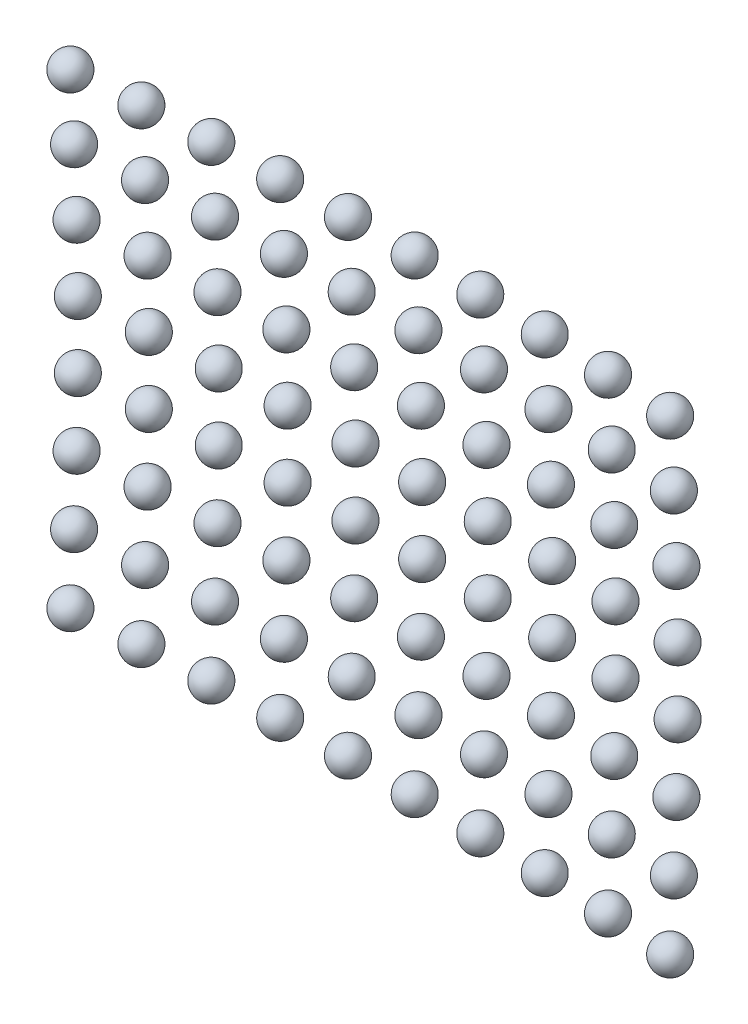
ISO-10303-21;
HEADER;
FILE_DESCRIPTION(('STEP AP214'),'2;1');
FILE_NAME('part.step','',(''),(''),'','','');
FILE_SCHEMA(('AUTOMOTIVE_DESIGN { 1 0 10303 214 1 1 1 1 }'));
ENDSEC;
DATA;
#1=APPLICATION_CONTEXT('core data for automotive mechanical design processes');
#2=APPLICATION_PROTOCOL_DEFINITION('international standard','automotive_design',2000,#1);
#3=PRODUCT_CONTEXT('',#1,'mechanical');
#4=PRODUCT('Part','Part','',(#3));
#5=PRODUCT_RELATED_PRODUCT_CATEGORY('part','',(#4));
#6=PRODUCT_DEFINITION_FORMATION('','',#4);
#7=PRODUCT_DEFINITION_CONTEXT('part definition',#1,'design');
#8=PRODUCT_DEFINITION('design','',#6,#7);
#9=PRODUCT_DEFINITION_SHAPE('','',#8);
#10=(LENGTH_UNIT() NAMED_UNIT(*) SI_UNIT(.MILLI.,.METRE.));
#11=(NAMED_UNIT(*) PLANE_ANGLE_UNIT() SI_UNIT($,.RADIAN.));
#12=(NAMED_UNIT(*) SI_UNIT($,.STERADIAN.) SOLID_ANGLE_UNIT());
#13=UNCERTAINTY_MEASURE_WITH_UNIT(LENGTH_MEASURE(1.E-05),#10,'distance_accuracy_value','');
#14=(GEOMETRIC_REPRESENTATION_CONTEXT(3) GLOBAL_UNCERTAINTY_ASSIGNED_CONTEXT((#13)) GLOBAL_UNIT_ASSIGNED_CONTEXT((#10,
#11,#12)) REPRESENTATION_CONTEXT('',''));
#15=CARTESIAN_POINT('',(0.,0.,0.));
#16=DIRECTION('',(0.,0.,1.));
#17=DIRECTION('',(1.,0.,0.));
#18=AXIS2_PLACEMENT_3D('',#15,#16,#17);
#19=CARTESIAN_POINT('',(8.00817179263601,-6.92631315586949,0.74810256034595));
#20=DIRECTION('',(0.,0.,-1.));
#21=DIRECTION('',(0.,-1.,0.));
#22=AXIS2_PLACEMENT_3D('',#19,#20,#21);
#23=SPHERICAL_SURFACE('',#22,0.5);
#24=CARTESIAN_POINT('',(8.00817179263601,-6.92631315586949,0.24810256034595));
#25=VERTEX_POINT('',#24);
#26=VERTEX_LOOP('',#25);
#27=FACE_BOUND('',#26,.T.);
#28=ADVANCED_FACE('F41',(#27),#23,.T.);
#29=CLOSED_SHELL('',(#28));
#30=MANIFOLD_SOLID_BREP('B2',#29);
#31=CARTESIAN_POINT('',(6.01259338943928,-6.92631315586949,0.615531929738802));
#32=DIRECTION('',(0.,0.,-1.));
#33=DIRECTION('',(0.,-1.,0.));
#34=AXIS2_PLACEMENT_3D('',#31,#32,#33);
#35=SPHERICAL_SURFACE('',#34,0.5);
#36=CARTESIAN_POINT('',(6.01259338943928,-6.92631315586949,0.115531929738802));
#37=VERTEX_POINT('',#36);
#38=VERTEX_LOOP('',#37);
#39=FACE_BOUND('',#38,.T.);
#40=ADVANCED_FACE('F61',(#39),#35,.T.);
#41=CLOSED_SHELL('',(#40));
#42=MANIFOLD_SOLID_BREP('B6',#41);
#43=CARTESIAN_POINT('',(4.01508925056326,-6.92631315586949,0.516106829396567));
#44=DIRECTION('',(0.,0.,-1.));
#45=DIRECTION('',(0.,-1.,0.));
#46=AXIS2_PLACEMENT_3D('',#43,#44,#45);
#47=SPHERICAL_SURFACE('',#46,0.5);
#48=CARTESIAN_POINT('',(4.01508925056326,-6.92631315586949,0.0161068293965674));
#49=VERTEX_POINT('',#48);
#50=VERTEX_LOOP('',#49);
#51=FACE_BOUND('',#50,.T.);
#52=ADVANCED_FACE('F81',(#51),#47,.T.);
#53=CLOSED_SHELL('',(#52));
#54=MANIFOLD_SOLID_BREP('B37',#53);
#55=CARTESIAN_POINT('',(2.01620986814937,-6.92631315586949,0.449854659881427));
#56=DIRECTION('',(0.,0.,-1.));
#57=DIRECTION('',(0.,-1.,0.));
#58=AXIS2_PLACEMENT_3D('',#55,#56,#57);
#59=SPHERICAL_SURFACE('',#58,0.5);
#60=CARTESIAN_POINT('',(2.01620986814937,-6.92631315586949,-0.0501453401185734));
#61=VERTEX_POINT('',#60);
#62=VERTEX_LOOP('',#61);
#63=FACE_BOUND('',#62,.T.);
#64=ADVANCED_FACE('F101',(#63),#59,.T.);
#65=CLOSED_SHELL('',(#64));
#66=MANIFOLD_SOLID_BREP('B57',#65);
#67=CARTESIAN_POINT('',(0.0165061133422777,-6.92631315586949,0.416793679628005));
#68=DIRECTION('',(0.,0.,-1.));
#69=DIRECTION('',(0.,-1.,0.));
#70=AXIS2_PLACEMENT_3D('',#67,#68,#69);
#71=SPHERICAL_SURFACE('',#70,0.5);
#72=CARTESIAN_POINT('',(0.0165061133422777,-6.92631315586949,-0.0832063203719949));
#73=VERTEX_POINT('',#72);
#74=VERTEX_LOOP('',#73);
#75=FACE_BOUND('',#74,.T.);
#76=ADVANCED_FACE('F121',(#75),#71,.T.);
#77=CLOSED_SHELL('',(#76));
#78=MANIFOLD_SOLID_BREP('B77',#77);
#79=CARTESIAN_POINT('',(-1.98347091552447,-6.92631315586949,0.416932999911426));
#80=DIRECTION('',(0.,0.,-1.));
#81=DIRECTION('',(0.,-1.,0.));
#82=AXIS2_PLACEMENT_3D('',#79,#80,#81);
#83=SPHERICAL_SURFACE('',#82,0.5);
#84=CARTESIAN_POINT('',(-1.98347091552447,-6.92631315586949,-0.0830670000885739));
#85=VERTEX_POINT('',#84);
#86=VERTEX_LOOP('',#85);
#87=FACE_BOUND('',#86,.T.);
#88=ADVANCED_FACE('F141',(#87),#83,.T.);
#89=CLOSED_SHELL('',(#88));
#90=MANIFOLD_SOLID_BREP('B97',#89);
#91=CARTESIAN_POINT('',(-3.98317004480583,-6.92631315586949,0.450272582336417));
#92=DIRECTION('',(0.,0.,-1.));
#93=DIRECTION('',(0.,-1.,0.));
#94=AXIS2_PLACEMENT_3D('',#91,#92,#93);
#95=SPHERICAL_SURFACE('',#94,0.5);
#96=CARTESIAN_POINT('',(-3.98317004480583,-6.92631315586949,-0.0497274176635835));
#97=VERTEX_POINT('',#96);
#98=VERTEX_LOOP('',#97);
#99=FACE_BOUND('',#98,.T.);
#100=ADVANCED_FACE('F161',(#99),#95,.T.);
#101=CLOSED_SHELL('',(#100));
#102=MANIFOLD_SOLID_BREP('B117',#101);
#103=CARTESIAN_POINT('',(-5.982040177443,-6.92631315586949,0.516803238847854));
#104=DIRECTION('',(0.,0.,-1.));
#105=DIRECTION('',(0.,-1.,0.));
#106=AXIS2_PLACEMENT_3D('',#103,#104,#105);
#107=SPHERICAL_SURFACE('',#106,0.5);
#108=CARTESIAN_POINT('',(-5.982040177443,-6.92631315586949,0.0168032388478542));
#109=VERTEX_POINT('',#108);
#110=VERTEX_LOOP('',#109);
#111=FACE_BOUND('',#110,.T.);
#112=ADVANCED_FACE('F181',(#111),#107,.T.);
#113=CLOSED_SHELL('',(#112));
#114=MANIFOLD_SOLID_BREP('B137',#113);
#115=CARTESIAN_POINT('',(-7.97953044484047,-6.92631315586949,0.616506634262936));
#116=DIRECTION('',(0.,0.,-1.));
#117=DIRECTION('',(0.,-1.,0.));
#118=AXIS2_PLACEMENT_3D('',#115,#116,#117);
#119=SPHERICAL_SURFACE('',#118,0.5);
#120=CARTESIAN_POINT('',(-7.97953044484047,-6.92631315586949,0.116506634262936));
#121=VERTEX_POINT('',#120);
#122=VERTEX_LOOP('',#121);
#123=FACE_BOUND('',#122,.T.);
#124=ADVANCED_FACE('F201',(#123),#119,.T.);
#125=CLOSED_SHELL('',(#124));
#126=MANIFOLD_SOLID_BREP('B157',#125);
#127=CARTESIAN_POINT('',(-9.97509035867965,-6.92631315586949,0.749355291324124));
#128=DIRECTION('',(0.,0.,-1.));
#129=DIRECTION('',(0.,-1.,0.));
#130=AXIS2_PLACEMENT_3D('',#127,#128,#129);
#131=SPHERICAL_SURFACE('',#130,0.5);
#132=CARTESIAN_POINT('',(-9.97509035867965,-6.92631315586949,0.249355291324124));
#133=VERTEX_POINT('',#132);
#134=VERTEX_LOOP('',#133);
#135=FACE_BOUND('',#134,.T.);
#136=ADVANCED_FACE('F221',(#135),#131,.T.);
#137=CLOSED_SHELL('',(#136));
#138=MANIFOLD_SOLID_BREP('B177',#137);
#139=CARTESIAN_POINT('',(8.00817179263601,-4.92945021760379,0.636643753140584));
#140=DIRECTION('',(0.,0.,-1.));
#141=DIRECTION('',(0.,-1.,0.));
#142=AXIS2_PLACEMENT_3D('',#139,#140,#141);
#143=SPHERICAL_SURFACE('',#142,0.5);
#144=CARTESIAN_POINT('',(8.00817179263601,-4.92945021760379,0.136643753140584));
#145=VERTEX_POINT('',#144);
#146=VERTEX_LOOP('',#145);
#147=FACE_BOUND('',#146,.T.);
#148=ADVANCED_FACE('F241',(#147),#143,.T.);
#149=CLOSED_SHELL('',(#148));
#150=MANIFOLD_SOLID_BREP('B197',#149);
#151=CARTESIAN_POINT('',(6.01259338943928,-4.92945021760379,0.504073122533435));
#152=DIRECTION('',(0.,0.,-1.));
#153=DIRECTION('',(0.,-1.,0.));
#154=AXIS2_PLACEMENT_3D('',#151,#152,#153);
#155=SPHERICAL_SURFACE('',#154,0.5);
#156=CARTESIAN_POINT('',(6.01259338943928,-4.92945021760379,0.00407312253343528));
#157=VERTEX_POINT('',#156);
#158=VERTEX_LOOP('',#157);
#159=FACE_BOUND('',#158,.T.);
#160=ADVANCED_FACE('F261',(#159),#155,.T.);
#161=CLOSED_SHELL('',(#160));
#162=MANIFOLD_SOLID_BREP('B217',#161);
#163=CARTESIAN_POINT('',(4.01508925056326,-4.92945021760379,0.404648022191201));
#164=DIRECTION('',(0.,0.,-1.));
#165=DIRECTION('',(0.,-1.,0.));
#166=AXIS2_PLACEMENT_3D('',#163,#164,#165);
#167=SPHERICAL_SURFACE('',#166,0.5);
#168=CARTESIAN_POINT('',(4.01508925056326,-4.92945021760379,-0.0953519778087994));
#169=VERTEX_POINT('',#168);
#170=VERTEX_LOOP('',#169);
#171=FACE_BOUND('',#170,.T.);
#172=ADVANCED_FACE('F281',(#171),#167,.T.);
#173=CLOSED_SHELL('',(#172));
#174=MANIFOLD_SOLID_BREP('B237',#173);
#175=CARTESIAN_POINT('',(2.01620986814937,-4.92945021760379,0.33839585267606));
#176=DIRECTION('',(0.,0.,-1.));
#177=DIRECTION('',(0.,-1.,0.));
#178=AXIS2_PLACEMENT_3D('',#175,#176,#177);
#179=SPHERICAL_SURFACE('',#178,0.5);
#180=CARTESIAN_POINT('',(2.01620986814937,-4.92945021760379,-0.16160414732394));
#181=VERTEX_POINT('',#180);
#182=VERTEX_LOOP('',#181);
#183=FACE_BOUND('',#182,.T.);
#184=ADVANCED_FACE('F301',(#183),#179,.T.);
#185=CLOSED_SHELL('',(#184));
#186=MANIFOLD_SOLID_BREP('B257',#185);
#187=CARTESIAN_POINT('',(0.0165061133422777,-4.92945021760379,0.305334872422638));
#188=DIRECTION('',(0.,0.,-1.));
#189=DIRECTION('',(0.,-1.,0.));
#190=AXIS2_PLACEMENT_3D('',#187,#188,#189);
#191=SPHERICAL_SURFACE('',#190,0.5);
#192=CARTESIAN_POINT('',(0.0165061133422777,-4.92945021760379,-0.194665127577362));
#193=VERTEX_POINT('',#192);
#194=VERTEX_LOOP('',#193);
#195=FACE_BOUND('',#194,.T.);
#196=ADVANCED_FACE('F321',(#195),#191,.T.);
#197=CLOSED_SHELL('',(#196));
#198=MANIFOLD_SOLID_BREP('B277',#197);
#199=CARTESIAN_POINT('',(-1.98347091552447,-4.92945021760379,0.305474192706059));
#200=DIRECTION('',(0.,0.,-1.));
#201=DIRECTION('',(0.,-1.,0.));
#202=AXIS2_PLACEMENT_3D('',#199,#200,#201);
#203=SPHERICAL_SURFACE('',#202,0.5);
#204=CARTESIAN_POINT('',(-1.98347091552447,-4.92945021760379,-0.194525807293941));
#205=VERTEX_POINT('',#204);
#206=VERTEX_LOOP('',#205);
#207=FACE_BOUND('',#206,.T.);
#208=ADVANCED_FACE('F341',(#207),#203,.T.);
#209=CLOSED_SHELL('',(#208));
#210=MANIFOLD_SOLID_BREP('B297',#209);
#211=CARTESIAN_POINT('',(-3.98317004480583,-4.92945021760379,0.33881377513105));
#212=DIRECTION('',(0.,0.,-1.));
#213=DIRECTION('',(0.,-1.,0.));
#214=AXIS2_PLACEMENT_3D('',#211,#212,#213);
#215=SPHERICAL_SURFACE('',#214,0.5);
#216=CARTESIAN_POINT('',(-3.98317004480583,-4.92945021760379,-0.16118622486895));
#217=VERTEX_POINT('',#216);
#218=VERTEX_LOOP('',#217);
#219=FACE_BOUND('',#218,.T.);
#220=ADVANCED_FACE('F361',(#219),#215,.T.);
#221=CLOSED_SHELL('',(#220));
#222=MANIFOLD_SOLID_BREP('B317',#221);
#223=CARTESIAN_POINT('',(-5.982040177443,-4.92945021760379,0.405344431642487));
#224=DIRECTION('',(0.,0.,-1.));
#225=DIRECTION('',(0.,-1.,0.));
#226=AXIS2_PLACEMENT_3D('',#223,#224,#225);
#227=SPHERICAL_SURFACE('',#226,0.5);
#228=CARTESIAN_POINT('',(-5.982040177443,-4.92945021760379,-0.0946555683575127));
#229=VERTEX_POINT('',#228);
#230=VERTEX_LOOP('',#229);
#231=FACE_BOUND('',#230,.T.);
#232=ADVANCED_FACE('F381',(#231),#227,.T.);
#233=CLOSED_SHELL('',(#232));
#234=MANIFOLD_SOLID_BREP('B337',#233);
#235=CARTESIAN_POINT('',(-7.97953044484047,-4.92945021760379,0.50504782705757));
#236=DIRECTION('',(0.,0.,-1.));
#237=DIRECTION('',(0.,-1.,0.));
#238=AXIS2_PLACEMENT_3D('',#235,#236,#237);
#239=SPHERICAL_SURFACE('',#238,0.5);
#240=CARTESIAN_POINT('',(-7.97953044484047,-4.92945021760379,0.00504782705756956));
#241=VERTEX_POINT('',#240);
#242=VERTEX_LOOP('',#241);
#243=FACE_BOUND('',#242,.T.);
#244=ADVANCED_FACE('F401',(#243),#239,.T.);
#245=CLOSED_SHELL('',(#244));
#246=MANIFOLD_SOLID_BREP('B357',#245);
#247=CARTESIAN_POINT('',(-9.97509035867965,-4.92945021760379,0.637896484118758));
#248=DIRECTION('',(0.,0.,-1.));
#249=DIRECTION('',(0.,-1.,0.));
#250=AXIS2_PLACEMENT_3D('',#247,#248,#249);
#251=SPHERICAL_SURFACE('',#250,0.5);
#252=CARTESIAN_POINT('',(-9.97509035867965,-4.92945021760379,0.137896484118758));
#253=VERTEX_POINT('',#252);
#254=VERTEX_LOOP('',#253);
#255=FACE_BOUND('',#254,.T.);
#256=ADVANCED_FACE('F421',(#255),#251,.T.);
#257=CLOSED_SHELL('',(#256));
#258=MANIFOLD_SOLID_BREP('B377',#257);
#259=CARTESIAN_POINT('',(8.00817179263601,-2.93085954418814,0.56234718485551));
#260=DIRECTION('',(0.,0.,-1.));
#261=DIRECTION('',(0.,-1.,0.));
#262=AXIS2_PLACEMENT_3D('',#259,#260,#261);
#263=SPHERICAL_SURFACE('',#262,0.5);
#264=CARTESIAN_POINT('',(8.00817179263601,-2.93085954418814,0.0623471848555104));
#265=VERTEX_POINT('',#264);
#266=VERTEX_LOOP('',#265);
#267=FACE_BOUND('',#266,.T.);
#268=ADVANCED_FACE('F441',(#267),#263,.T.);
#269=CLOSED_SHELL('',(#268));
#270=MANIFOLD_SOLID_BREP('B397',#269);
#271=CARTESIAN_POINT('',(6.01259338943928,-2.93085954418814,0.429776554248362));
#272=DIRECTION('',(0.,0.,-1.));
#273=DIRECTION('',(0.,-1.,0.));
#274=AXIS2_PLACEMENT_3D('',#271,#272,#273);
#275=SPHERICAL_SURFACE('',#274,0.5);
#276=CARTESIAN_POINT('',(6.01259338943928,-2.93085954418814,-0.070223445751638));
#277=VERTEX_POINT('',#276);
#278=VERTEX_LOOP('',#277);
#279=FACE_BOUND('',#278,.T.);
#280=ADVANCED_FACE('F461',(#279),#275,.T.);
#281=CLOSED_SHELL('',(#280));
#282=MANIFOLD_SOLID_BREP('B417',#281);
#283=CARTESIAN_POINT('',(4.01508925056326,-2.93085954418814,0.330351453906127));
#284=DIRECTION('',(0.,0.,-1.));
#285=DIRECTION('',(0.,-1.,0.));
#286=AXIS2_PLACEMENT_3D('',#283,#284,#285);
#287=SPHERICAL_SURFACE('',#286,0.5);
#288=CARTESIAN_POINT('',(4.01508925056326,-2.93085954418814,-0.169648546093873));
#289=VERTEX_POINT('',#288);
#290=VERTEX_LOOP('',#289);
#291=FACE_BOUND('',#290,.T.);
#292=ADVANCED_FACE('F481',(#291),#287,.T.);
#293=CLOSED_SHELL('',(#292));
#294=MANIFOLD_SOLID_BREP('B437',#293);
#295=CARTESIAN_POINT('',(2.01620986814937,-2.93085954418814,0.264099284390987));
#296=DIRECTION('',(0.,0.,-1.));
#297=DIRECTION('',(0.,-1.,0.));
#298=AXIS2_PLACEMENT_3D('',#295,#296,#297);
#299=SPHERICAL_SURFACE('',#298,0.5);
#300=CARTESIAN_POINT('',(2.01620986814937,-2.93085954418814,-0.235900715609013));
#301=VERTEX_POINT('',#300);
#302=VERTEX_LOOP('',#301);
#303=FACE_BOUND('',#302,.T.);
#304=ADVANCED_FACE('F501',(#303),#299,.T.);
#305=CLOSED_SHELL('',(#304));
#306=MANIFOLD_SOLID_BREP('B457',#305);
#307=CARTESIAN_POINT('',(0.0165061133422777,-2.93085954418814,0.231038304137565));
#308=DIRECTION('',(0.,0.,-1.));
#309=DIRECTION('',(0.,-1.,0.));
#310=AXIS2_PLACEMENT_3D('',#307,#308,#309);
#311=SPHERICAL_SURFACE('',#310,0.5);
#312=CARTESIAN_POINT('',(0.0165061133422777,-2.93085954418814,-0.268961695862435));
#313=VERTEX_POINT('',#312);
#314=VERTEX_LOOP('',#313);
#315=FACE_BOUND('',#314,.T.);
#316=ADVANCED_FACE('F521',(#315),#311,.T.);
#317=CLOSED_SHELL('',(#316));
#318=MANIFOLD_SOLID_BREP('B477',#317);
#319=CARTESIAN_POINT('',(-1.98347091552447,-2.93085954418814,0.231177624420986));
#320=DIRECTION('',(0.,0.,-1.));
#321=DIRECTION('',(0.,-1.,0.));
#322=AXIS2_PLACEMENT_3D('',#319,#320,#321);
#323=SPHERICAL_SURFACE('',#322,0.5);
#324=CARTESIAN_POINT('',(-1.98347091552447,-2.93085954418814,-0.268822375579014));
#325=VERTEX_POINT('',#324);
#326=VERTEX_LOOP('',#325);
#327=FACE_BOUND('',#326,.T.);
#328=ADVANCED_FACE('F541',(#327),#323,.T.);
#329=CLOSED_SHELL('',(#328));
#330=MANIFOLD_SOLID_BREP('B497',#329);
#331=CARTESIAN_POINT('',(-3.98317004480583,-2.93085954418814,0.264517206845976));
#332=DIRECTION('',(0.,0.,-1.));
#333=DIRECTION('',(0.,-1.,0.));
#334=AXIS2_PLACEMENT_3D('',#331,#332,#333);
#335=SPHERICAL_SURFACE('',#334,0.5);
#336=CARTESIAN_POINT('',(-3.98317004480583,-2.93085954418814,-0.235482793154024));
#337=VERTEX_POINT('',#336);
#338=VERTEX_LOOP('',#337);
#339=FACE_BOUND('',#338,.T.);
#340=ADVANCED_FACE('F561',(#339),#335,.T.);
#341=CLOSED_SHELL('',(#340));
#342=MANIFOLD_SOLID_BREP('B517',#341);
#343=CARTESIAN_POINT('',(-5.982040177443,-2.93085954418814,0.331047863357414));
#344=DIRECTION('',(0.,0.,-1.));
#345=DIRECTION('',(0.,-1.,0.));
#346=AXIS2_PLACEMENT_3D('',#343,#344,#345);
#347=SPHERICAL_SURFACE('',#346,0.5);
#348=CARTESIAN_POINT('',(-5.982040177443,-2.93085954418814,-0.168952136642586));
#349=VERTEX_POINT('',#348);
#350=VERTEX_LOOP('',#349);
#351=FACE_BOUND('',#350,.T.);
#352=ADVANCED_FACE('F581',(#351),#347,.T.);
#353=CLOSED_SHELL('',(#352));
#354=MANIFOLD_SOLID_BREP('B537',#353);
#355=CARTESIAN_POINT('',(-7.97953044484047,-2.93085954418814,0.430751258772496));
#356=DIRECTION('',(0.,0.,-1.));
#357=DIRECTION('',(0.,-1.,0.));
#358=AXIS2_PLACEMENT_3D('',#355,#356,#357);
#359=SPHERICAL_SURFACE('',#358,0.5);
#360=CARTESIAN_POINT('',(-7.97953044484047,-2.93085954418814,-0.0692487412275037));
#361=VERTEX_POINT('',#360);
#362=VERTEX_LOOP('',#361);
#363=FACE_BOUND('',#362,.T.);
#364=ADVANCED_FACE('F601',(#363),#359,.T.);
#365=CLOSED_SHELL('',(#364));
#366=MANIFOLD_SOLID_BREP('B557',#365);
#367=CARTESIAN_POINT('',(-9.97509035867965,-2.93085954418814,0.563599915833684));
#368=DIRECTION('',(0.,0.,-1.));
#369=DIRECTION('',(0.,-1.,0.));
#370=AXIS2_PLACEMENT_3D('',#367,#368,#369);
#371=SPHERICAL_SURFACE('',#370,0.5);
#372=CARTESIAN_POINT('',(-9.97509035867965,-2.93085954418814,0.0635999158336844));
#373=VERTEX_POINT('',#372);
#374=VERTEX_LOOP('',#373);
#375=FACE_BOUND('',#374,.T.);
#376=ADVANCED_FACE('F621',(#375),#371,.T.);
#377=CLOSED_SHELL('',(#376));
#378=MANIFOLD_SOLID_BREP('B577',#377);
#379=CARTESIAN_POINT('',(8.00817179263601,-0.931232676465381,0.525238563161723));
#380=DIRECTION('',(0.,0.,-1.));
#381=DIRECTION('',(0.,-1.,0.));
#382=AXIS2_PLACEMENT_3D('',#379,#380,#381);
#383=SPHERICAL_SURFACE('',#382,0.5);
#384=CARTESIAN_POINT('',(8.00817179263601,-0.931232676465381,0.0252385631617227));
#385=VERTEX_POINT('',#384);
#386=VERTEX_LOOP('',#385);
#387=FACE_BOUND('',#386,.T.);
#388=ADVANCED_FACE('F641',(#387),#383,.T.);
#389=CLOSED_SHELL('',(#388));
#390=MANIFOLD_SOLID_BREP('B597',#389);
#391=CARTESIAN_POINT('',(6.01259338943928,-0.931232676465381,0.392667932554574));
#392=DIRECTION('',(0.,0.,-1.));
#393=DIRECTION('',(0.,-1.,0.));
#394=AXIS2_PLACEMENT_3D('',#391,#392,#393);
#395=SPHERICAL_SURFACE('',#394,0.5);
#396=CARTESIAN_POINT('',(6.01259338943928,-0.931232676465381,-0.107332067445426));
#397=VERTEX_POINT('',#396);
#398=VERTEX_LOOP('',#397);
#399=FACE_BOUND('',#398,.T.);
#400=ADVANCED_FACE('F661',(#399),#395,.T.);
#401=CLOSED_SHELL('',(#400));
#402=MANIFOLD_SOLID_BREP('B617',#401);
#403=CARTESIAN_POINT('',(4.01508925056326,-0.931232676465381,0.29324283221234));
#404=DIRECTION('',(0.,0.,-1.));
#405=DIRECTION('',(0.,-1.,0.));
#406=AXIS2_PLACEMENT_3D('',#403,#404,#405);
#407=SPHERICAL_SURFACE('',#406,0.5);
#408=CARTESIAN_POINT('',(4.01508925056326,-0.931232676465381,-0.20675716778766));
#409=VERTEX_POINT('',#408);
#410=VERTEX_LOOP('',#409);
#411=FACE_BOUND('',#410,.T.);
#412=ADVANCED_FACE('F681',(#411),#407,.T.);
#413=CLOSED_SHELL('',(#412));
#414=MANIFOLD_SOLID_BREP('B637',#413);
#415=CARTESIAN_POINT('',(2.01620986814937,-0.931232676465381,0.226990662697199));
#416=DIRECTION('',(0.,0.,-1.));
#417=DIRECTION('',(0.,-1.,0.));
#418=AXIS2_PLACEMENT_3D('',#415,#416,#417);
#419=SPHERICAL_SURFACE('',#418,0.5);
#420=CARTESIAN_POINT('',(2.01620986814937,-0.931232676465381,-0.273009337302801));
#421=VERTEX_POINT('',#420);
#422=VERTEX_LOOP('',#421);
#423=FACE_BOUND('',#422,.T.);
#424=ADVANCED_FACE('F701',(#423),#419,.T.);
#425=CLOSED_SHELL('',(#424));
#426=MANIFOLD_SOLID_BREP('B657',#425);
#427=CARTESIAN_POINT('',(0.0165061133422777,-0.931232676465381,0.193929682443777));
#428=DIRECTION('',(0.,0.,-1.));
#429=DIRECTION('',(0.,-1.,0.));
#430=AXIS2_PLACEMENT_3D('',#427,#428,#429);
#431=SPHERICAL_SURFACE('',#430,0.5);
#432=CARTESIAN_POINT('',(0.0165061133422777,-0.931232676465381,-0.306070317556223));
#433=VERTEX_POINT('',#432);
#434=VERTEX_LOOP('',#433);
#435=FACE_BOUND('',#434,.T.);
#436=ADVANCED_FACE('F721',(#435),#431,.T.);
#437=CLOSED_SHELL('',(#436));
#438=MANIFOLD_SOLID_BREP('B677',#437);
#439=CARTESIAN_POINT('',(-1.98347091552447,-0.931232676465381,0.194069002727198));
#440=DIRECTION('',(0.,0.,-1.));
#441=DIRECTION('',(0.,-1.,0.));
#442=AXIS2_PLACEMENT_3D('',#439,#440,#441);
#443=SPHERICAL_SURFACE('',#442,0.5);
#444=CARTESIAN_POINT('',(-1.98347091552447,-0.931232676465381,-0.305930997272802));
#445=VERTEX_POINT('',#444);
#446=VERTEX_LOOP('',#445);
#447=FACE_BOUND('',#446,.T.);
#448=ADVANCED_FACE('F741',(#447),#443,.T.);
#449=CLOSED_SHELL('',(#448));
#450=MANIFOLD_SOLID_BREP('B697',#449);
#451=CARTESIAN_POINT('',(-3.98317004480583,-0.931232676465381,0.227408585152189));
#452=DIRECTION('',(0.,0.,-1.));
#453=DIRECTION('',(0.,-1.,0.));
#454=AXIS2_PLACEMENT_3D('',#451,#452,#453);
#455=SPHERICAL_SURFACE('',#454,0.5);
#456=CARTESIAN_POINT('',(-3.98317004480583,-0.931232676465381,-0.272591414847811));
#457=VERTEX_POINT('',#456);
#458=VERTEX_LOOP('',#457);
#459=FACE_BOUND('',#458,.T.);
#460=ADVANCED_FACE('F761',(#459),#455,.T.);
#461=CLOSED_SHELL('',(#460));
#462=MANIFOLD_SOLID_BREP('B717',#461);
#463=CARTESIAN_POINT('',(-5.982040177443,-0.931232676465381,0.293939241663626));
#464=DIRECTION('',(0.,0.,-1.));
#465=DIRECTION('',(0.,-1.,0.));
#466=AXIS2_PLACEMENT_3D('',#463,#464,#465);
#467=SPHERICAL_SURFACE('',#466,0.5);
#468=CARTESIAN_POINT('',(-5.982040177443,-0.931232676465381,-0.206060758336374));
#469=VERTEX_POINT('',#468);
#470=VERTEX_LOOP('',#469);
#471=FACE_BOUND('',#470,.T.);
#472=ADVANCED_FACE('F781',(#471),#467,.T.);
#473=CLOSED_SHELL('',(#472));
#474=MANIFOLD_SOLID_BREP('B737',#473);
#475=CARTESIAN_POINT('',(-7.97953044484047,-0.931232676465381,0.393642637078709));
#476=DIRECTION('',(0.,0.,-1.));
#477=DIRECTION('',(0.,-1.,0.));
#478=AXIS2_PLACEMENT_3D('',#475,#476,#477);
#479=SPHERICAL_SURFACE('',#478,0.5);
#480=CARTESIAN_POINT('',(-7.97953044484047,-0.931232676465381,-0.106357362921291));
#481=VERTEX_POINT('',#480);
#482=VERTEX_LOOP('',#481);
#483=FACE_BOUND('',#482,.T.);
#484=ADVANCED_FACE('F801',(#483),#479,.T.);
#485=CLOSED_SHELL('',(#484));
#486=MANIFOLD_SOLID_BREP('B757',#485);
#487=CARTESIAN_POINT('',(-9.97509035867965,-0.931232676465381,0.526491294139897));
#488=DIRECTION('',(0.,0.,-1.));
#489=DIRECTION('',(0.,-1.,0.));
#490=AXIS2_PLACEMENT_3D('',#487,#488,#489);
#491=SPHERICAL_SURFACE('',#490,0.5);
#492=CARTESIAN_POINT('',(-9.97509035867965,-0.931232676465381,0.0264912941398967));
#493=VERTEX_POINT('',#492);
#494=VERTEX_LOOP('',#493);
#495=FACE_BOUND('',#494,.T.);
#496=ADVANCED_FACE('F821',(#495),#491,.T.);
#497=CLOSED_SHELL('',(#496));
#498=MANIFOLD_SOLID_BREP('B777',#497);
#499=CARTESIAN_POINT('',(8.00817179263601,1.06873848618381,0.525330728170903));
#500=DIRECTION('',(0.,0.,-1.));
#501=DIRECTION('',(0.,-1.,0.));
#502=AXIS2_PLACEMENT_3D('',#499,#500,#501);
#503=SPHERICAL_SURFACE('',#502,0.5);
#504=CARTESIAN_POINT('',(8.00817179263601,1.06873848618381,0.0253307281709028));
#505=VERTEX_POINT('',#504);
#506=VERTEX_LOOP('',#505);
#507=FACE_BOUND('',#506,.T.);
#508=ADVANCED_FACE('F841',(#507),#503,.T.);
#509=CLOSED_SHELL('',(#508));
#510=MANIFOLD_SOLID_BREP('B797',#509);
#511=CARTESIAN_POINT('',(6.01259338943928,1.06873848618381,0.392760097563754));
#512=DIRECTION('',(0.,0.,-1.));
#513=DIRECTION('',(0.,-1.,0.));
#514=AXIS2_PLACEMENT_3D('',#511,#512,#513);
#515=SPHERICAL_SURFACE('',#514,0.5);
#516=CARTESIAN_POINT('',(6.01259338943928,1.06873848618381,-0.107239902436246));
#517=VERTEX_POINT('',#516);
#518=VERTEX_LOOP('',#517);
#519=FACE_BOUND('',#518,.T.);
#520=ADVANCED_FACE('F861',(#519),#515,.T.);
#521=CLOSED_SHELL('',(#520));
#522=MANIFOLD_SOLID_BREP('B817',#521);
#523=CARTESIAN_POINT('',(4.01508925056326,1.06873848618381,0.29333499722152));
#524=DIRECTION('',(0.,0.,-1.));
#525=DIRECTION('',(0.,-1.,0.));
#526=AXIS2_PLACEMENT_3D('',#523,#524,#525);
#527=SPHERICAL_SURFACE('',#526,0.5);
#528=CARTESIAN_POINT('',(4.01508925056326,1.06873848618381,-0.20666500277848));
#529=VERTEX_POINT('',#528);
#530=VERTEX_LOOP('',#529);
#531=FACE_BOUND('',#530,.T.);
#532=ADVANCED_FACE('F881',(#531),#527,.T.);
#533=CLOSED_SHELL('',(#532));
#534=MANIFOLD_SOLID_BREP('B837',#533);
#535=CARTESIAN_POINT('',(2.01620986814937,1.06873848618381,0.227082827706379));
#536=DIRECTION('',(0.,0.,-1.));
#537=DIRECTION('',(0.,-1.,0.));
#538=AXIS2_PLACEMENT_3D('',#535,#536,#537);
#539=SPHERICAL_SURFACE('',#538,0.5);
#540=CARTESIAN_POINT('',(2.01620986814937,1.06873848618381,-0.272917172293621));
#541=VERTEX_POINT('',#540);
#542=VERTEX_LOOP('',#541);
#543=FACE_BOUND('',#542,.T.);
#544=ADVANCED_FACE('F901',(#543),#539,.T.);
#545=CLOSED_SHELL('',(#544));
#546=MANIFOLD_SOLID_BREP('B857',#545);
#547=CARTESIAN_POINT('',(0.0165061133422777,1.06873848618381,0.194021847452957));
#548=DIRECTION('',(0.,0.,-1.));
#549=DIRECTION('',(0.,-1.,0.));
#550=AXIS2_PLACEMENT_3D('',#547,#548,#549);
#551=SPHERICAL_SURFACE('',#550,0.5);
#552=CARTESIAN_POINT('',(0.0165061133422777,1.06873848618381,-0.305978152547043));
#553=VERTEX_POINT('',#552);
#554=VERTEX_LOOP('',#553);
#555=FACE_BOUND('',#554,.T.);
#556=ADVANCED_FACE('F921',(#555),#551,.T.);
#557=CLOSED_SHELL('',(#556));
#558=MANIFOLD_SOLID_BREP('B877',#557);
#559=CARTESIAN_POINT('',(-1.98347091552447,1.06873848618381,0.194161167736378));
#560=DIRECTION('',(0.,0.,-1.));
#561=DIRECTION('',(0.,-1.,0.));
#562=AXIS2_PLACEMENT_3D('',#559,#560,#561);
#563=SPHERICAL_SURFACE('',#562,0.5);
#564=CARTESIAN_POINT('',(-1.98347091552447,1.06873848618381,-0.305838832263622));
#565=VERTEX_POINT('',#564);
#566=VERTEX_LOOP('',#565);
#567=FACE_BOUND('',#566,.T.);
#568=ADVANCED_FACE('F941',(#567),#563,.T.);
#569=CLOSED_SHELL('',(#568));
#570=MANIFOLD_SOLID_BREP('B897',#569);
#571=CARTESIAN_POINT('',(-3.98317004480583,1.06873848618381,0.227500750161369));
#572=DIRECTION('',(0.,0.,-1.));
#573=DIRECTION('',(0.,-1.,0.));
#574=AXIS2_PLACEMENT_3D('',#571,#572,#573);
#575=SPHERICAL_SURFACE('',#574,0.5);
#576=CARTESIAN_POINT('',(-3.98317004480583,1.06873848618381,-0.272499249838631));
#577=VERTEX_POINT('',#576);
#578=VERTEX_LOOP('',#577);
#579=FACE_BOUND('',#578,.T.);
#580=ADVANCED_FACE('F961',(#579),#575,.T.);
#581=CLOSED_SHELL('',(#580));
#582=MANIFOLD_SOLID_BREP('B917',#581);
#583=CARTESIAN_POINT('',(-5.982040177443,1.06873848618381,0.294031406672806));
#584=DIRECTION('',(0.,0.,-1.));
#585=DIRECTION('',(0.,-1.,0.));
#586=AXIS2_PLACEMENT_3D('',#583,#584,#585);
#587=SPHERICAL_SURFACE('',#586,0.5);
#588=CARTESIAN_POINT('',(-5.982040177443,1.06873848618381,-0.205968593327194));
#589=VERTEX_POINT('',#588);
#590=VERTEX_LOOP('',#589);
#591=FACE_BOUND('',#590,.T.);
#592=ADVANCED_FACE('F981',(#591),#587,.T.);
#593=CLOSED_SHELL('',(#592));
#594=MANIFOLD_SOLID_BREP('B937',#593);
#595=CARTESIAN_POINT('',(-7.97953044484047,1.06873848618381,0.393734802087889));
#596=DIRECTION('',(0.,0.,-1.));
#597=DIRECTION('',(0.,-1.,0.));
#598=AXIS2_PLACEMENT_3D('',#595,#596,#597);
#599=SPHERICAL_SURFACE('',#598,0.5);
#600=CARTESIAN_POINT('',(-7.97953044484047,1.06873848618381,-0.106265197912111));
#601=VERTEX_POINT('',#600);
#602=VERTEX_LOOP('',#601);
#603=FACE_BOUND('',#602,.T.);
#604=ADVANCED_FACE('F1001',(#603),#599,.T.);
#605=CLOSED_SHELL('',(#604));
#606=MANIFOLD_SOLID_BREP('B957',#605);
#607=CARTESIAN_POINT('',(-9.97509035867965,1.06873848618381,0.526583459149077));
#608=DIRECTION('',(0.,0.,-1.));
#609=DIRECTION('',(0.,-1.,0.));
#610=AXIS2_PLACEMENT_3D('',#607,#608,#609);
#611=SPHERICAL_SURFACE('',#610,0.5);
#612=CARTESIAN_POINT('',(-9.97509035867965,1.06873848618381,0.0265834591490768));
#613=VERTEX_POINT('',#612);
#614=VERTEX_LOOP('',#613);
#615=FACE_BOUND('',#614,.T.);
#616=ADVANCED_FACE('F1021',(#615),#611,.T.);
#617=CLOSED_SHELL('',(#616));
#618=MANIFOLD_SOLID_BREP('B977',#617);
#619=CARTESIAN_POINT('',(8.00817179263601,3.06836192524776,0.562623647992671));
#620=DIRECTION('',(0.,0.,-1.));
#621=DIRECTION('',(0.,-1.,0.));
#622=AXIS2_PLACEMENT_3D('',#619,#620,#621);
#623=SPHERICAL_SURFACE('',#622,0.5);
#624=CARTESIAN_POINT('',(8.00817179263601,3.06836192524776,0.0626236479926714));
#625=VERTEX_POINT('',#624);
#626=VERTEX_LOOP('',#625);
#627=FACE_BOUND('',#626,.T.);
#628=ADVANCED_FACE('F1041',(#627),#623,.T.);
#629=CLOSED_SHELL('',(#628));
#630=MANIFOLD_SOLID_BREP('B997',#629);
#631=CARTESIAN_POINT('',(6.01259338943928,3.06836192524776,0.430053017385523));
#632=DIRECTION('',(0.,0.,-1.));
#633=DIRECTION('',(0.,-1.,0.));
#634=AXIS2_PLACEMENT_3D('',#631,#632,#633);
#635=SPHERICAL_SURFACE('',#634,0.5);
#636=CARTESIAN_POINT('',(6.01259338943928,3.06836192524776,-0.069946982614477));
#637=VERTEX_POINT('',#636);
#638=VERTEX_LOOP('',#637);
#639=FACE_BOUND('',#638,.T.);
#640=ADVANCED_FACE('F1061',(#639),#635,.T.);
#641=CLOSED_SHELL('',(#640));
#642=MANIFOLD_SOLID_BREP('B1017',#641);
#643=CARTESIAN_POINT('',(4.01508925056326,3.06836192524776,0.330627917043288));
#644=DIRECTION('',(0.,0.,-1.));
#645=DIRECTION('',(0.,-1.,0.));
#646=AXIS2_PLACEMENT_3D('',#643,#644,#645);
#647=SPHERICAL_SURFACE('',#646,0.5);
#648=CARTESIAN_POINT('',(4.01508925056326,3.06836192524776,-0.169372082956712));
#649=VERTEX_POINT('',#648);
#650=VERTEX_LOOP('',#649);
#651=FACE_BOUND('',#650,.T.);
#652=ADVANCED_FACE('F1081',(#651),#647,.T.);
#653=CLOSED_SHELL('',(#652));
#654=MANIFOLD_SOLID_BREP('B1037',#653);
#655=CARTESIAN_POINT('',(2.01620986814937,3.06836192524776,0.264375747528148));
#656=DIRECTION('',(0.,0.,-1.));
#657=DIRECTION('',(0.,-1.,0.));
#658=AXIS2_PLACEMENT_3D('',#655,#656,#657);
#659=SPHERICAL_SURFACE('',#658,0.5);
#660=CARTESIAN_POINT('',(2.01620986814937,3.06836192524776,-0.235624252471852));
#661=VERTEX_POINT('',#660);
#662=VERTEX_LOOP('',#661);
#663=FACE_BOUND('',#662,.T.);
#664=ADVANCED_FACE('F1101',(#663),#659,.T.);
#665=CLOSED_SHELL('',(#664));
#666=MANIFOLD_SOLID_BREP('B1057',#665);
#667=CARTESIAN_POINT('',(0.0165061133422777,3.06836192524776,0.231314767274726));
#668=DIRECTION('',(0.,0.,-1.));
#669=DIRECTION('',(0.,-1.,0.));
#670=AXIS2_PLACEMENT_3D('',#667,#668,#669);
#671=SPHERICAL_SURFACE('',#670,0.5);
#672=CARTESIAN_POINT('',(0.0165061133422777,3.06836192524776,-0.268685232725274));
#673=VERTEX_POINT('',#672);
#674=VERTEX_LOOP('',#673);
#675=FACE_BOUND('',#674,.T.);
#676=ADVANCED_FACE('F1121',(#675),#671,.T.);
#677=CLOSED_SHELL('',(#676));
#678=MANIFOLD_SOLID_BREP('B1077',#677);
#679=CARTESIAN_POINT('',(-1.98347091552447,3.06836192524776,0.231454087558147));
#680=DIRECTION('',(0.,0.,-1.));
#681=DIRECTION('',(0.,-1.,0.));
#682=AXIS2_PLACEMENT_3D('',#679,#680,#681);
#683=SPHERICAL_SURFACE('',#682,0.5);
#684=CARTESIAN_POINT('',(-1.98347091552447,3.06836192524776,-0.268545912441853));
#685=VERTEX_POINT('',#684);
#686=VERTEX_LOOP('',#685);
#687=FACE_BOUND('',#686,.T.);
#688=ADVANCED_FACE('F1141',(#687),#683,.T.);
#689=CLOSED_SHELL('',(#688));
#690=MANIFOLD_SOLID_BREP('B1097',#689);
#691=CARTESIAN_POINT('',(-3.98317004480583,3.06836192524776,0.264793669983137));
#692=DIRECTION('',(0.,0.,-1.));
#693=DIRECTION('',(0.,-1.,0.));
#694=AXIS2_PLACEMENT_3D('',#691,#692,#693);
#695=SPHERICAL_SURFACE('',#694,0.5);
#696=CARTESIAN_POINT('',(-3.98317004480583,3.06836192524776,-0.235206330016863));
#697=VERTEX_POINT('',#696);
#698=VERTEX_LOOP('',#697);
#699=FACE_BOUND('',#698,.T.);
#700=ADVANCED_FACE('F1161',(#699),#695,.T.);
#701=CLOSED_SHELL('',(#700));
#702=MANIFOLD_SOLID_BREP('B1117',#701);
#703=CARTESIAN_POINT('',(-5.982040177443,3.06836192524776,0.331324326494575));
#704=DIRECTION('',(0.,0.,-1.));
#705=DIRECTION('',(0.,-1.,0.));
#706=AXIS2_PLACEMENT_3D('',#703,#704,#705);
#707=SPHERICAL_SURFACE('',#706,0.5);
#708=CARTESIAN_POINT('',(-5.982040177443,3.06836192524776,-0.168675673505425));
#709=VERTEX_POINT('',#708);
#710=VERTEX_LOOP('',#709);
#711=FACE_BOUND('',#710,.T.);
#712=ADVANCED_FACE('F1181',(#711),#707,.T.);
#713=CLOSED_SHELL('',(#712));
#714=MANIFOLD_SOLID_BREP('B1137',#713);
#715=CARTESIAN_POINT('',(-7.97953044484047,3.06836192524776,0.431027721909657));
#716=DIRECTION('',(0.,0.,-1.));
#717=DIRECTION('',(0.,-1.,0.));
#718=AXIS2_PLACEMENT_3D('',#715,#716,#717);
#719=SPHERICAL_SURFACE('',#718,0.5);
#720=CARTESIAN_POINT('',(-7.97953044484047,3.06836192524776,-0.0689722780903427));
#721=VERTEX_POINT('',#720);
#722=VERTEX_LOOP('',#721);
#723=FACE_BOUND('',#722,.T.);
#724=ADVANCED_FACE('F1201',(#723),#719,.T.);
#725=CLOSED_SHELL('',(#724));
#726=MANIFOLD_SOLID_BREP('B1157',#725);
#727=CARTESIAN_POINT('',(-9.97509035867965,3.06836192524776,0.563876378970845));
#728=DIRECTION('',(0.,0.,-1.));
#729=DIRECTION('',(0.,-1.,0.));
#730=AXIS2_PLACEMENT_3D('',#727,#728,#729);
#731=SPHERICAL_SURFACE('',#730,0.5);
#732=CARTESIAN_POINT('',(-9.97509035867965,3.06836192524776,0.0638763789708454));
#733=VERTEX_POINT('',#732);
#734=VERTEX_LOOP('',#733);
#735=FACE_BOUND('',#734,.T.);
#736=ADVANCED_FACE('F1221',(#735),#731,.T.);
#737=CLOSED_SHELL('',(#736));
#738=MANIFOLD_SOLID_BREP('B1177',#737);
#739=CARTESIAN_POINT('',(8.00817179263601,5.06694574253209,0.637104418745537));
#740=DIRECTION('',(0.,0.,-1.));
#741=DIRECTION('',(0.,-1.,0.));
#742=AXIS2_PLACEMENT_3D('',#739,#740,#741);
#743=SPHERICAL_SURFACE('',#742,0.5);
#744=CARTESIAN_POINT('',(8.00817179263601,5.06694574253209,0.137104418745537));
#745=VERTEX_POINT('',#744);
#746=VERTEX_LOOP('',#745);
#747=FACE_BOUND('',#746,.T.);
#748=ADVANCED_FACE('F1241',(#747),#743,.T.);
#749=CLOSED_SHELL('',(#748));
#750=MANIFOLD_SOLID_BREP('B1197',#749);
#751=CARTESIAN_POINT('',(6.01259338943928,5.06694574253209,0.504533788138389));
#752=DIRECTION('',(0.,0.,-1.));
#753=DIRECTION('',(0.,-1.,0.));
#754=AXIS2_PLACEMENT_3D('',#751,#752,#753);
#755=SPHERICAL_SURFACE('',#754,0.5);
#756=CARTESIAN_POINT('',(6.01259338943928,5.06694574253209,0.00453378813838911));
#757=VERTEX_POINT('',#756);
#758=VERTEX_LOOP('',#757);
#759=FACE_BOUND('',#758,.T.);
#760=ADVANCED_FACE('F1261',(#759),#755,.T.);
#761=CLOSED_SHELL('',(#760));
#762=MANIFOLD_SOLID_BREP('B1217',#761);
#763=CARTESIAN_POINT('',(4.01508925056326,5.06694574253209,0.405108687796154));
#764=DIRECTION('',(0.,0.,-1.));
#765=DIRECTION('',(0.,-1.,0.));
#766=AXIS2_PLACEMENT_3D('',#763,#764,#765);
#767=SPHERICAL_SURFACE('',#766,0.5);
#768=CARTESIAN_POINT('',(4.01508925056326,5.06694574253209,-0.0948913122038456));
#769=VERTEX_POINT('',#768);
#770=VERTEX_LOOP('',#769);
#771=FACE_BOUND('',#770,.T.);
#772=ADVANCED_FACE('F1281',(#771),#767,.T.);
#773=CLOSED_SHELL('',(#772));
#774=MANIFOLD_SOLID_BREP('B1237',#773);
#775=CARTESIAN_POINT('',(2.01620986814937,5.06694574253209,0.338856518281014));
#776=DIRECTION('',(0.,0.,-1.));
#777=DIRECTION('',(0.,-1.,0.));
#778=AXIS2_PLACEMENT_3D('',#775,#776,#777);
#779=SPHERICAL_SURFACE('',#778,0.5);
#780=CARTESIAN_POINT('',(2.01620986814937,5.06694574253209,-0.161143481718986));
#781=VERTEX_POINT('',#780);
#782=VERTEX_LOOP('',#781);
#783=FACE_BOUND('',#782,.T.);
#784=ADVANCED_FACE('F1301',(#783),#779,.T.);
#785=CLOSED_SHELL('',(#784));
#786=MANIFOLD_SOLID_BREP('B1257',#785);
#787=CARTESIAN_POINT('',(0.0165061133422777,5.06694574253209,0.305795538027592));
#788=DIRECTION('',(0.,0.,-1.));
#789=DIRECTION('',(0.,-1.,0.));
#790=AXIS2_PLACEMENT_3D('',#787,#788,#789);
#791=SPHERICAL_SURFACE('',#790,0.5);
#792=CARTESIAN_POINT('',(0.0165061133422777,5.06694574253209,-0.194204461972408));
#793=VERTEX_POINT('',#792);
#794=VERTEX_LOOP('',#793);
#795=FACE_BOUND('',#794,.T.);
#796=ADVANCED_FACE('F1321',(#795),#791,.T.);
#797=CLOSED_SHELL('',(#796));
#798=MANIFOLD_SOLID_BREP('B1277',#797);
#799=CARTESIAN_POINT('',(-1.98347091552447,5.06694574253209,0.305934858311013));
#800=DIRECTION('',(0.,0.,-1.));
#801=DIRECTION('',(0.,-1.,0.));
#802=AXIS2_PLACEMENT_3D('',#799,#800,#801);
#803=SPHERICAL_SURFACE('',#802,0.5);
#804=CARTESIAN_POINT('',(-1.98347091552447,5.06694574253209,-0.194065141688987));
#805=VERTEX_POINT('',#804);
#806=VERTEX_LOOP('',#805);
#807=FACE_BOUND('',#806,.T.);
#808=ADVANCED_FACE('F1341',(#807),#803,.T.);
#809=CLOSED_SHELL('',(#808));
#810=MANIFOLD_SOLID_BREP('B1297',#809);
#811=CARTESIAN_POINT('',(-3.98317004480583,5.06694574253209,0.339274440736004));
#812=DIRECTION('',(0.,0.,-1.));
#813=DIRECTION('',(0.,-1.,0.));
#814=AXIS2_PLACEMENT_3D('',#811,#812,#813);
#815=SPHERICAL_SURFACE('',#814,0.5);
#816=CARTESIAN_POINT('',(-3.98317004480583,5.06694574253209,-0.160725559263996));
#817=VERTEX_POINT('',#816);
#818=VERTEX_LOOP('',#817);
#819=FACE_BOUND('',#818,.T.);
#820=ADVANCED_FACE('F1361',(#819),#815,.T.);
#821=CLOSED_SHELL('',(#820));
#822=MANIFOLD_SOLID_BREP('B1317',#821);
#823=CARTESIAN_POINT('',(-5.982040177443,5.06694574253209,0.405805097247441));
#824=DIRECTION('',(0.,0.,-1.));
#825=DIRECTION('',(0.,-1.,0.));
#826=AXIS2_PLACEMENT_3D('',#823,#824,#825);
#827=SPHERICAL_SURFACE('',#826,0.5);
#828=CARTESIAN_POINT('',(-5.982040177443,5.06694574253209,-0.0941949027525588));
#829=VERTEX_POINT('',#828);
#830=VERTEX_LOOP('',#829);
#831=FACE_BOUND('',#830,.T.);
#832=ADVANCED_FACE('F1381',(#831),#827,.T.);
#833=CLOSED_SHELL('',(#832));
#834=MANIFOLD_SOLID_BREP('B1337',#833);
#835=CARTESIAN_POINT('',(-7.97953044484047,5.06694574253209,0.505508492662523));
#836=DIRECTION('',(0.,0.,-1.));
#837=DIRECTION('',(0.,-1.,0.));
#838=AXIS2_PLACEMENT_3D('',#835,#836,#837);
#839=SPHERICAL_SURFACE('',#838,0.5);
#840=CARTESIAN_POINT('',(-7.97953044484047,5.06694574253209,0.0055084926625234));
#841=VERTEX_POINT('',#840);
#842=VERTEX_LOOP('',#841);
#843=FACE_BOUND('',#842,.T.);
#844=ADVANCED_FACE('F1401',(#843),#839,.T.);
#845=CLOSED_SHELL('',(#844));
#846=MANIFOLD_SOLID_BREP('B1357',#845);
#847=CARTESIAN_POINT('',(-9.97509035867965,5.06694574253209,0.638357149723711));
#848=DIRECTION('',(0.,0.,-1.));
#849=DIRECTION('',(0.,-1.,0.));
#850=AXIS2_PLACEMENT_3D('',#847,#848,#849);
#851=SPHERICAL_SURFACE('',#850,0.5);
#852=CARTESIAN_POINT('',(-9.97509035867965,5.06694574253209,0.138357149723711));
#853=VERTEX_POINT('',#852);
#854=VERTEX_LOOP('',#853);
#855=FACE_BOUND('',#854,.T.);
#856=ADVANCED_FACE('F1421',(#855),#851,.T.);
#857=CLOSED_SHELL('',(#856));
#858=MANIFOLD_SOLID_BREP('B1377',#857);
#859=CARTESIAN_POINT('',(8.00817179263601,7.06379839956644,0.74874726902184));
#860=DIRECTION('',(0.,0.,-1.));
#861=DIRECTION('',(0.,-1.,0.));
#862=AXIS2_PLACEMENT_3D('',#859,#860,#861);
#863=SPHERICAL_SURFACE('',#862,0.5);
#864=CARTESIAN_POINT('',(8.00817179263601,7.06379839956644,0.24874726902184));
#865=VERTEX_POINT('',#864);
#866=VERTEX_LOOP('',#865);
#867=FACE_BOUND('',#866,.T.);
#868=ADVANCED_FACE('F1441',(#867),#863,.T.);
#869=CLOSED_SHELL('',(#868));
#870=MANIFOLD_SOLID_BREP('B1397',#869);
#871=CARTESIAN_POINT('',(6.01259338943928,7.06379839956644,0.616176638414692));
#872=DIRECTION('',(0.,0.,-1.));
#873=DIRECTION('',(0.,-1.,0.));
#874=AXIS2_PLACEMENT_3D('',#871,#872,#873);
#875=SPHERICAL_SURFACE('',#874,0.5);
#876=CARTESIAN_POINT('',(6.01259338943928,7.06379839956644,0.116176638414692));
#877=VERTEX_POINT('',#876);
#878=VERTEX_LOOP('',#877);
#879=FACE_BOUND('',#878,.T.);
#880=ADVANCED_FACE('F1461',(#879),#875,.T.);
#881=CLOSED_SHELL('',(#880));
#882=MANIFOLD_SOLID_BREP('B1417',#881);
#883=CARTESIAN_POINT('',(4.01508925056326,7.06379839956644,0.516751538072457));
#884=DIRECTION('',(0.,0.,-1.));
#885=DIRECTION('',(0.,-1.,0.));
#886=AXIS2_PLACEMENT_3D('',#883,#884,#885);
#887=SPHERICAL_SURFACE('',#886,0.5);
#888=CARTESIAN_POINT('',(4.01508925056326,7.06379839956644,0.0167515380724572));
#889=VERTEX_POINT('',#888);
#890=VERTEX_LOOP('',#889);
#891=FACE_BOUND('',#890,.T.);
#892=ADVANCED_FACE('F1481',(#891),#887,.T.);
#893=CLOSED_SHELL('',(#892));
#894=MANIFOLD_SOLID_BREP('B1437',#893);
#895=CARTESIAN_POINT('',(2.01620986814937,7.06379839956644,0.450499368557316));
#896=DIRECTION('',(0.,0.,-1.));
#897=DIRECTION('',(0.,-1.,0.));
#898=AXIS2_PLACEMENT_3D('',#895,#896,#897);
#899=SPHERICAL_SURFACE('',#898,0.5);
#900=CARTESIAN_POINT('',(2.01620986814937,7.06379839956644,-0.0495006314426836));
#901=VERTEX_POINT('',#900);
#902=VERTEX_LOOP('',#901);
#903=FACE_BOUND('',#902,.T.);
#904=ADVANCED_FACE('F1501',(#903),#899,.T.);
#905=CLOSED_SHELL('',(#904));
#906=MANIFOLD_SOLID_BREP('B1457',#905);
#907=CARTESIAN_POINT('',(0.0165061133422777,7.06379839956644,0.417438388303895));
#908=DIRECTION('',(0.,0.,-1.));
#909=DIRECTION('',(0.,-1.,0.));
#910=AXIS2_PLACEMENT_3D('',#907,#908,#909);
#911=SPHERICAL_SURFACE('',#910,0.5);
#912=CARTESIAN_POINT('',(0.0165061133422777,7.06379839956644,-0.0825616116961051));
#913=VERTEX_POINT('',#912);
#914=VERTEX_LOOP('',#913);
#915=FACE_BOUND('',#914,.T.);
#916=ADVANCED_FACE('F1521',(#915),#911,.T.);
#917=CLOSED_SHELL('',(#916));
#918=MANIFOLD_SOLID_BREP('B1477',#917);
#919=CARTESIAN_POINT('',(-1.98347091552447,7.06379839956644,0.417577708587316));
#920=DIRECTION('',(0.,0.,-1.));
#921=DIRECTION('',(0.,-1.,0.));
#922=AXIS2_PLACEMENT_3D('',#919,#920,#921);
#923=SPHERICAL_SURFACE('',#922,0.5);
#924=CARTESIAN_POINT('',(-1.98347091552447,7.06379839956644,-0.0824222914126841));
#925=VERTEX_POINT('',#924);
#926=VERTEX_LOOP('',#925);
#927=FACE_BOUND('',#926,.T.);
#928=ADVANCED_FACE('F1541',(#927),#923,.T.);
#929=CLOSED_SHELL('',(#928));
#930=MANIFOLD_SOLID_BREP('B1497',#929);
#931=CARTESIAN_POINT('',(-3.98317004480583,7.06379839956644,0.450917291012306));
#932=DIRECTION('',(0.,0.,-1.));
#933=DIRECTION('',(0.,-1.,0.));
#934=AXIS2_PLACEMENT_3D('',#931,#932,#933);
#935=SPHERICAL_SURFACE('',#934,0.5);
#936=CARTESIAN_POINT('',(-3.98317004480583,7.06379839956644,-0.0490827089876936));
#937=VERTEX_POINT('',#936);
#938=VERTEX_LOOP('',#937);
#939=FACE_BOUND('',#938,.T.);
#940=ADVANCED_FACE('F1561',(#939),#935,.T.);
#941=CLOSED_SHELL('',(#940));
#942=MANIFOLD_SOLID_BREP('B1517',#941);
#943=CARTESIAN_POINT('',(-5.982040177443,7.06379839956644,0.517447947523744));
#944=DIRECTION('',(0.,0.,-1.));
#945=DIRECTION('',(0.,-1.,0.));
#946=AXIS2_PLACEMENT_3D('',#943,#944,#945);
#947=SPHERICAL_SURFACE('',#946,0.5);
#948=CARTESIAN_POINT('',(-5.982040177443,7.06379839956644,0.017447947523744));
#949=VERTEX_POINT('',#948);
#950=VERTEX_LOOP('',#949);
#951=FACE_BOUND('',#950,.T.);
#952=ADVANCED_FACE('F1581',(#951),#947,.T.);
#953=CLOSED_SHELL('',(#952));
#954=MANIFOLD_SOLID_BREP('B1537',#953);
#955=CARTESIAN_POINT('',(-7.97953044484047,7.06379839956644,0.617151342938826));
#956=DIRECTION('',(0.,0.,-1.));
#957=DIRECTION('',(0.,-1.,0.));
#958=AXIS2_PLACEMENT_3D('',#955,#956,#957);
#959=SPHERICAL_SURFACE('',#958,0.5);
#960=CARTESIAN_POINT('',(-7.97953044484047,7.06379839956644,0.117151342938826));
#961=VERTEX_POINT('',#960);
#962=VERTEX_LOOP('',#961);
#963=FACE_BOUND('',#962,.T.);
#964=ADVANCED_FACE('F1600',(#963),#959,.T.);
#965=CLOSED_SHELL('',(#964));
#966=MANIFOLD_SOLID_BREP('B1557',#965);
#967=CARTESIAN_POINT('',(-9.97509035867964,7.06379839956644,0.75));
#968=DIRECTION('',(0.,0.,-1.));
#969=DIRECTION('',(0.,-1.,0.));
#970=AXIS2_PLACEMENT_3D('',#967,#968,#969);
#971=SPHERICAL_SURFACE('',#970,0.5);
#972=CARTESIAN_POINT('',(-9.97509035867964,7.06379839956644,0.25));
#973=VERTEX_POINT('',#972);
#974=VERTEX_LOOP('',#973);
#975=FACE_BOUND('',#974,.T.);
#976=ADVANCED_FACE('F1614',(#975),#971,.T.);
#977=CLOSED_SHELL('',(#976));
#978=MANIFOLD_SOLID_BREP('B1577',#977);
#979=ADVANCED_BREP_SHAPE_REPRESENTATION('',(#18,#30,#42,#54,#66,#78,#90,#102,#114,#126,#138,
#150,#162,#174,#186,#198,#210,#222,#234,#246,#258,#270,#282,#294,#306,#318,#330,#342,#354,#366,
#378,#390,#402,#414,#426,#438,#450,#462,#474,#486,#498,#510,#522,#534,#546,#558,#570,#582,#594,
#606,#618,#630,#642,#654,#666,#678,#690,#702,#714,#726,#738,#750,#762,#774,#786,#798,#810,#822,
#834,#846,#858,#870,#882,#894,#906,#918,#930,#942,#954,#966,#978),#14);
#980=SHAPE_DEFINITION_REPRESENTATION(#9,#979);
ENDSEC;
END-ISO-10303-21;
